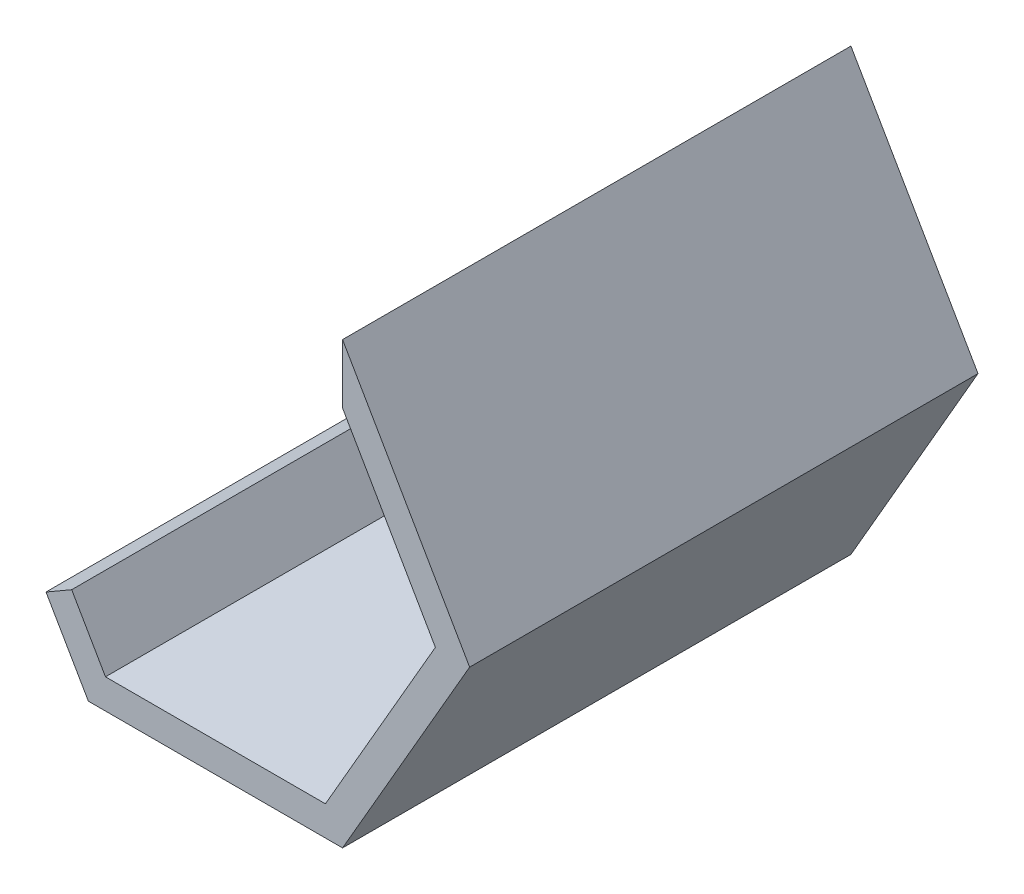
ISO-10303-21;
HEADER;
FILE_DESCRIPTION(('STEP AP214'),'2;1');
FILE_NAME('part.step','',(''),(''),'','','');
FILE_SCHEMA(('AUTOMOTIVE_DESIGN { 1 0 10303 214 1 1 1 1 }'));
ENDSEC;
DATA;
#1=APPLICATION_CONTEXT('core data for automotive mechanical design processes');
#2=APPLICATION_PROTOCOL_DEFINITION('international standard','automotive_design',2000,#1);
#3=PRODUCT_CONTEXT('',#1,'mechanical');
#4=PRODUCT('Part','Part','',(#3));
#5=PRODUCT_RELATED_PRODUCT_CATEGORY('part','',(#4));
#6=PRODUCT_DEFINITION_FORMATION('','',#4);
#7=PRODUCT_DEFINITION_CONTEXT('part definition',#1,'design');
#8=PRODUCT_DEFINITION('design','',#6,#7);
#9=PRODUCT_DEFINITION_SHAPE('','',#8);
#10=(LENGTH_UNIT() NAMED_UNIT(*) SI_UNIT(.MILLI.,.METRE.));
#11=(NAMED_UNIT(*) PLANE_ANGLE_UNIT() SI_UNIT($,.RADIAN.));
#12=(NAMED_UNIT(*) SI_UNIT($,.STERADIAN.) SOLID_ANGLE_UNIT());
#13=UNCERTAINTY_MEASURE_WITH_UNIT(LENGTH_MEASURE(1.E-05),#10,'distance_accuracy_value','');
#14=(GEOMETRIC_REPRESENTATION_CONTEXT(3) GLOBAL_UNCERTAINTY_ASSIGNED_CONTEXT((#13)) GLOBAL_UNIT_ASSIGNED_CONTEXT((#10,
#11,#12)) REPRESENTATION_CONTEXT('',''));
#15=CARTESIAN_POINT('',(0.,0.,0.));
#16=DIRECTION('',(0.,0.,1.));
#17=DIRECTION('',(1.,0.,0.));
#18=AXIS2_PLACEMENT_3D('',#15,#16,#17);
#19=CARTESIAN_POINT('',(-148.616811639848,-25.4663748274563,120.));
#20=DIRECTION('',(0.866025403784439,0.5,0.));
#21=DIRECTION('',(-0.5,0.866025403784439,0.));
#22=AXIS2_PLACEMENT_3D('',#19,#20,#21);
#23=PLANE('',#22);
#24=DIRECTION('',(0.5,-0.866025403784439,0.));
#25=VECTOR('',#24,1.);
#26=CARTESIAN_POINT('',(-148.616811639848,-25.4663748274563,0.));
#27=LINE('',#26,#25);
#28=CARTESIAN_POINT('',(-158.616811639848,-8.1458667517675,0.));
#29=VERTEX_POINT('',#28);
#30=CARTESIAN_POINT('',(-148.616811639848,-25.4663748274563,0.));
#31=VERTEX_POINT('',#30);
#32=EDGE_CURVE('E141',#29,#31,#27,.T.);
#33=ORIENTED_EDGE('',*,*,#32,.T.);
#34=DIRECTION('',(0.,0.,-1.));
#35=VECTOR('',#34,1.);
#36=CARTESIAN_POINT('',(-148.616811639848,-25.4663748274563,120.));
#37=LINE('',#36,#35);
#38=CARTESIAN_POINT('',(-148.616811639848,-25.4663748274563,120.));
#39=VERTEX_POINT('',#38);
#40=EDGE_CURVE('E11',#39,#31,#37,.T.);
#41=ORIENTED_EDGE('',*,*,#40,.F.);
#42=DIRECTION('',(0.5,-0.866025403784439,0.));
#43=VECTOR('',#42,1.);
#44=CARTESIAN_POINT('',(-148.616811639848,-25.4663748274563,120.));
#45=LINE('',#44,#43);
#46=CARTESIAN_POINT('',(-158.616811639848,-8.1458667517675,120.));
#47=VERTEX_POINT('',#46);
#48=EDGE_CURVE('E161',#47,#39,#45,.T.);
#49=ORIENTED_EDGE('',*,*,#48,.F.);
#50=DIRECTION('',(0.,0.,-1.));
#51=VECTOR('',#50,1.);
#52=CARTESIAN_POINT('',(-158.616811639848,-8.1458667517675,120.));
#53=LINE('',#52,#51);
#54=EDGE_CURVE('E137',#47,#29,#53,.T.);
#55=ORIENTED_EDGE('',*,*,#54,.T.);
#56=EDGE_LOOP('',(#33,#41,#49,#55));
#57=FACE_BOUND('',#56,.T.);
#58=ADVANCED_FACE('F33',(#57),#23,.F.);
#59=CARTESIAN_POINT('',(-148.616811639848,-25.4663748274563,120.));
#60=DIRECTION('',(0.,1.,0.));
#61=DIRECTION('',(-1.,0.,0.));
#62=AXIS2_PLACEMENT_3D('',#59,#60,#61);
#63=PLANE('',#62);
#64=DIRECTION('',(1.,0.,0.));
#65=VECTOR('',#64,1.);
#66=CARTESIAN_POINT('',(-148.616811639848,-25.4663748274563,0.));
#67=LINE('',#66,#65);
#68=CARTESIAN_POINT('',(-88.6168116398483,-25.4663748274563,0.));
#69=VERTEX_POINT('',#68);
#70=EDGE_CURVE('E144',#31,#69,#67,.T.);
#71=ORIENTED_EDGE('',*,*,#70,.T.);
#72=DIRECTION('',(0.,0.,-1.));
#73=VECTOR('',#72,1.);
#74=CARTESIAN_POINT('',(-88.6168116398483,-25.4663748274563,120.));
#75=LINE('',#74,#73);
#76=CARTESIAN_POINT('',(-88.6168116398483,-25.4663748274563,120.));
#77=VERTEX_POINT('',#76);
#78=EDGE_CURVE('E41',#77,#69,#75,.T.);
#79=ORIENTED_EDGE('',*,*,#78,.F.);
#80=DIRECTION('',(1.,0.,0.));
#81=VECTOR('',#80,1.);
#82=CARTESIAN_POINT('',(-148.616811639848,-25.4663748274563,120.));
#83=LINE('',#82,#81);
#84=EDGE_CURVE('E98',#39,#77,#83,.T.);
#85=ORIENTED_EDGE('',*,*,#84,.F.);
#86=ORIENTED_EDGE('',*,*,#40,.T.);
#87=EDGE_LOOP('',(#71,#79,#85,#86));
#88=FACE_BOUND('',#87,.T.);
#89=ADVANCED_FACE('F208',(#88),#63,.F.);
#90=CARTESIAN_POINT('',(-88.6168116398483,-25.4663748274563,120.));
#91=DIRECTION('',(-0.866025403784439,0.5,0.));
#92=DIRECTION('',(-0.5,-0.866025403784439,0.));
#93=AXIS2_PLACEMENT_3D('',#90,#91,#92);
#94=PLANE('',#93);
#95=DIRECTION('',(0.5,0.866025403784439,0.));
#96=VECTOR('',#95,1.);
#97=CARTESIAN_POINT('',(-88.6168116398483,-25.4663748274563,0.));
#98=LINE('',#97,#96);
#99=CARTESIAN_POINT('',(-58.6168116398483,26.49514939961,0.));
#100=VERTEX_POINT('',#99);
#101=EDGE_CURVE('E146',#69,#100,#98,.T.);
#102=ORIENTED_EDGE('',*,*,#101,.T.);
#103=DIRECTION('',(0.,0.,-1.));
#104=VECTOR('',#103,1.);
#105=CARTESIAN_POINT('',(-58.6168116398483,26.49514939961,120.));
#106=LINE('',#105,#104);
#107=CARTESIAN_POINT('',(-58.6168116398483,26.49514939961,120.));
#108=VERTEX_POINT('',#107);
#109=EDGE_CURVE('E174',#108,#100,#106,.T.);
#110=ORIENTED_EDGE('',*,*,#109,.F.);
#111=DIRECTION('',(0.5,0.866025403784439,0.));
#112=VECTOR('',#111,1.);
#113=CARTESIAN_POINT('',(-88.6168116398483,-25.4663748274563,120.));
#114=LINE('',#113,#112);
#115=EDGE_CURVE('E182',#77,#108,#114,.T.);
#116=ORIENTED_EDGE('',*,*,#115,.F.);
#117=ORIENTED_EDGE('',*,*,#78,.T.);
#118=EDGE_LOOP('',(#102,#110,#116,#117));
#119=FACE_BOUND('',#118,.T.);
#120=ADVANCED_FACE('F180',(#119),#94,.F.);
#121=CARTESIAN_POINT('',(-58.6168116398483,26.49514939961,120.));
#122=DIRECTION('',(-0.866025403784439,-0.5,0.));
#123=DIRECTION('',(0.5,-0.866025403784439,0.));
#124=AXIS2_PLACEMENT_3D('',#121,#122,#123);
#125=PLANE('',#124);
#126=DIRECTION('',(-0.5,0.866025403784439,0.));
#127=VECTOR('',#126,1.);
#128=CARTESIAN_POINT('',(-58.6168116398483,26.49514939961,0.));
#129=LINE('',#128,#127);
#130=CARTESIAN_POINT('',(-88.6168116398483,78.4566736266763,0.));
#131=VERTEX_POINT('',#130);
#132=EDGE_CURVE('E148',#100,#131,#129,.T.);
#133=ORIENTED_EDGE('',*,*,#132,.T.);
#134=DIRECTION('',(0.,0.,-1.));
#135=VECTOR('',#134,1.);
#136=CARTESIAN_POINT('',(-88.6168116398483,78.4566736266763,120.));
#137=LINE('',#136,#135);
#138=CARTESIAN_POINT('',(-88.6168116398483,78.4566736266763,120.));
#139=VERTEX_POINT('',#138);
#140=EDGE_CURVE('E171',#139,#131,#137,.T.);
#141=ORIENTED_EDGE('',*,*,#140,.F.);
#142=DIRECTION('',(-0.5,0.866025403784439,0.));
#143=VECTOR('',#142,1.);
#144=CARTESIAN_POINT('',(-58.6168116398483,26.49514939961,120.));
#145=LINE('',#144,#143);
#146=EDGE_CURVE('E198',#108,#139,#145,.T.);
#147=ORIENTED_EDGE('',*,*,#146,.F.);
#148=ORIENTED_EDGE('',*,*,#109,.T.);
#149=EDGE_LOOP('',(#133,#141,#147,#148));
#150=FACE_BOUND('',#149,.T.);
#151=ADVANCED_FACE('F189',(#150),#125,.F.);
#152=CARTESIAN_POINT('',(-88.6168116398483,64.4566736266762,120.));
#153=DIRECTION('',(1.,0.,0.));
#154=DIRECTION('',(0.,0.,-1.));
#155=AXIS2_PLACEMENT_3D('',#152,#153,#154);
#156=PLANE('',#155);
#157=DIRECTION('',(0.,-1.,0.));
#158=VECTOR('',#157,1.);
#159=CARTESIAN_POINT('',(-88.6168116398483,64.4566736266762,0.));
#160=LINE('',#159,#158);
#161=CARTESIAN_POINT('',(-88.6168116398483,64.4566736266762,0.));
#162=VERTEX_POINT('',#161);
#163=EDGE_CURVE('E151',#131,#162,#160,.T.);
#164=ORIENTED_EDGE('',*,*,#163,.T.);
#165=DIRECTION('',(0.,0.,-1.));
#166=VECTOR('',#165,1.);
#167=CARTESIAN_POINT('',(-88.6168116398483,64.4566736266762,120.));
#168=LINE('',#167,#166);
#169=CARTESIAN_POINT('',(-88.6168116398483,64.4566736266762,120.));
#170=VERTEX_POINT('',#169);
#171=EDGE_CURVE('E168',#170,#162,#168,.T.);
#172=ORIENTED_EDGE('',*,*,#171,.F.);
#173=DIRECTION('',(0.,-1.,0.));
#174=VECTOR('',#173,1.);
#175=CARTESIAN_POINT('',(-88.6168116398483,78.4566736266763,120.));
#176=LINE('',#175,#174);
#177=EDGE_CURVE('E195',#139,#170,#176,.T.);
#178=ORIENTED_EDGE('',*,*,#177,.F.);
#179=ORIENTED_EDGE('',*,*,#140,.T.);
#180=EDGE_LOOP('',(#164,#172,#178,#179));
#181=FACE_BOUND('',#180,.T.);
#182=ADVANCED_FACE('F193',(#181),#156,.F.);
#183=CARTESIAN_POINT('',(-82.2800555855672,53.4810901854917,120.));
#184=DIRECTION('',(0.866025403784439,0.5,0.));
#185=DIRECTION('',(-0.5,0.866025403784439,0.));
#186=AXIS2_PLACEMENT_3D('',#183,#184,#185);
#187=PLANE('',#186);
#188=DIRECTION('',(0.5,-0.866025403784439,0.));
#189=VECTOR('',#188,1.);
#190=CARTESIAN_POINT('',(-82.2800555855672,53.4810901854917,0.));
#191=LINE('',#190,#189);
#192=CARTESIAN_POINT('',(-66.699715408503,26.4951493996098,0.));
#193=VERTEX_POINT('',#192);
#194=EDGE_CURVE('E154',#162,#193,#191,.T.);
#195=ORIENTED_EDGE('',*,*,#194,.T.);
#196=DIRECTION('',(0.,0.,-1.));
#197=VECTOR('',#196,1.);
#198=CARTESIAN_POINT('',(-66.699715408503,26.4951493996098,120.));
#199=LINE('',#198,#197);
#200=CARTESIAN_POINT('',(-66.699715408503,26.4951493996098,120.));
#201=VERTEX_POINT('',#200);
#202=EDGE_CURVE('E165',#201,#193,#199,.T.);
#203=ORIENTED_EDGE('',*,*,#202,.F.);
#204=DIRECTION('',(0.5,-0.866025403784439,0.));
#205=VECTOR('',#204,1.);
#206=CARTESIAN_POINT('',(-82.2800555855672,53.4810901854917,120.));
#207=LINE('',#206,#205);
#208=EDGE_CURVE('E197',#170,#201,#207,.T.);
#209=ORIENTED_EDGE('',*,*,#208,.F.);
#210=ORIENTED_EDGE('',*,*,#171,.T.);
#211=EDGE_LOOP('',(#195,#203,#209,#210));
#212=FACE_BOUND('',#211,.T.);
#213=ADVANCED_FACE('F220',(#212),#187,.F.);
#214=CARTESIAN_POINT('',(-92.6582635241753,-18.4663748274562,120.));
#215=DIRECTION('',(0.86602540378444,-0.499999999999998,0.));
#216=DIRECTION('',(0.499999999999998,0.86602540378444,0.));
#217=AXIS2_PLACEMENT_3D('',#214,#215,#216);
#218=PLANE('',#217);
#219=DIRECTION('',(-0.499999999999998,-0.86602540378444,0.));
#220=VECTOR('',#219,1.);
#221=CARTESIAN_POINT('',(-92.6582635241753,-18.4663748274562,0.));
#222=LINE('',#221,#220);
#223=CARTESIAN_POINT('',(-92.6582635241753,-18.4663748274562,0.));
#224=VERTEX_POINT('',#223);
#225=EDGE_CURVE('E156',#193,#224,#222,.T.);
#226=ORIENTED_EDGE('',*,*,#225,.T.);
#227=DIRECTION('',(0.,0.,-1.));
#228=VECTOR('',#227,1.);
#229=CARTESIAN_POINT('',(-92.6582635241753,-18.4663748274562,120.));
#230=LINE('',#229,#228);
#231=CARTESIAN_POINT('',(-92.6582635241753,-18.4663748274562,120.));
#232=VERTEX_POINT('',#231);
#233=EDGE_CURVE('E132',#232,#224,#230,.T.);
#234=ORIENTED_EDGE('',*,*,#233,.F.);
#235=DIRECTION('',(-0.499999999999998,-0.86602540378444,0.));
#236=VECTOR('',#235,1.);
#237=CARTESIAN_POINT('',(-92.6582635241753,-18.4663748274562,120.));
#238=LINE('',#237,#236);
#239=EDGE_CURVE('E123',#201,#232,#238,.T.);
#240=ORIENTED_EDGE('',*,*,#239,.F.);
#241=ORIENTED_EDGE('',*,*,#202,.T.);
#242=EDGE_LOOP('',(#226,#234,#240,#241));
#243=FACE_BOUND('',#242,.T.);
#244=ADVANCED_FACE('F223',(#243),#218,.F.);
#245=CARTESIAN_POINT('',(-144.575359755521,-18.4663748274562,120.));
#246=DIRECTION('',(0.,-1.,0.));
#247=DIRECTION('',(0.,0.,-1.));
#248=AXIS2_PLACEMENT_3D('',#245,#246,#247);
#249=PLANE('',#248);
#250=DIRECTION('',(-1.,0.,0.));
#251=VECTOR('',#250,1.);
#252=CARTESIAN_POINT('',(-144.575359755521,-18.4663748274562,0.));
#253=LINE('',#252,#251);
#254=CARTESIAN_POINT('',(-144.575359755521,-18.4663748274562,0.));
#255=VERTEX_POINT('',#254);
#256=EDGE_CURVE('E131',#224,#255,#253,.T.);
#257=ORIENTED_EDGE('',*,*,#256,.T.);
#258=DIRECTION('',(0.,0.,-1.));
#259=VECTOR('',#258,1.);
#260=CARTESIAN_POINT('',(-144.575359755521,-18.4663748274562,120.));
#261=LINE('',#260,#259);
#262=CARTESIAN_POINT('',(-144.575359755521,-18.4663748274562,120.));
#263=VERTEX_POINT('',#262);
#264=EDGE_CURVE('E128',#263,#255,#261,.T.);
#265=ORIENTED_EDGE('',*,*,#264,.F.);
#266=DIRECTION('',(-1.,0.,0.));
#267=VECTOR('',#266,1.);
#268=CARTESIAN_POINT('',(-144.575359755521,-18.4663748274562,120.));
#269=LINE('',#268,#267);
#270=EDGE_CURVE('E117',#232,#263,#269,.T.);
#271=ORIENTED_EDGE('',*,*,#270,.F.);
#272=ORIENTED_EDGE('',*,*,#233,.T.);
#273=EDGE_LOOP('',(#257,#265,#271,#272));
#274=FACE_BOUND('',#273,.T.);
#275=ADVANCED_FACE('F129',(#274),#249,.F.);
#276=CARTESIAN_POINT('',(-152.554633813357,-4.64586675176749,120.));
#277=DIRECTION('',(-0.866025403784428,-0.500000000000018,0.));
#278=DIRECTION('',(0.500000000000018,-0.866025403784428,0.));
#279=AXIS2_PLACEMENT_3D('',#276,#277,#278);
#280=PLANE('',#279);
#281=DIRECTION('',(-0.500000000000018,0.866025403784428,0.));
#282=VECTOR('',#281,1.);
#283=CARTESIAN_POINT('',(-152.554633813357,-4.64586675176749,0.));
#284=LINE('',#283,#282);
#285=CARTESIAN_POINT('',(-152.554633813357,-4.64586675176749,0.));
#286=VERTEX_POINT('',#285);
#287=EDGE_CURVE('E84',#255,#286,#284,.T.);
#288=ORIENTED_EDGE('',*,*,#287,.T.);
#289=DIRECTION('',(0.,0.,-1.));
#290=VECTOR('',#289,1.);
#291=CARTESIAN_POINT('',(-152.554633813357,-4.64586675176749,120.));
#292=LINE('',#291,#290);
#293=CARTESIAN_POINT('',(-152.554633813357,-4.64586675176749,120.));
#294=VERTEX_POINT('',#293);
#295=EDGE_CURVE('E133',#294,#286,#292,.T.);
#296=ORIENTED_EDGE('',*,*,#295,.F.);
#297=DIRECTION('',(-0.500000000000018,0.866025403784428,0.));
#298=VECTOR('',#297,1.);
#299=CARTESIAN_POINT('',(-152.554633813357,-4.64586675176749,120.));
#300=LINE('',#299,#298);
#301=EDGE_CURVE('E121',#263,#294,#300,.T.);
#302=ORIENTED_EDGE('',*,*,#301,.F.);
#303=ORIENTED_EDGE('',*,*,#264,.T.);
#304=EDGE_LOOP('',(#288,#296,#302,#303));
#305=FACE_BOUND('',#304,.T.);
#306=ADVANCED_FACE('F135',(#305),#280,.F.);
#307=CARTESIAN_POINT('',(-158.616811639848,-8.1458667517675,120.));
#308=DIRECTION('',(0.500000000000001,-0.866025403784438,0.));
#309=DIRECTION('',(0.866025403784438,0.500000000000001,0.));
#310=AXIS2_PLACEMENT_3D('',#307,#308,#309);
#311=PLANE('',#310);
#312=DIRECTION('',(-0.866025403784438,-0.500000000000001,0.));
#313=VECTOR('',#312,1.);
#314=CARTESIAN_POINT('',(-158.616811639848,-8.1458667517675,0.));
#315=LINE('',#314,#313);
#316=EDGE_CURVE('E90',#286,#29,#315,.T.);
#317=ORIENTED_EDGE('',*,*,#316,.T.);
#318=ORIENTED_EDGE('',*,*,#54,.F.);
#319=DIRECTION('',(-0.866025403784438,-0.500000000000001,0.));
#320=VECTOR('',#319,1.);
#321=CARTESIAN_POINT('',(-158.616811639848,-8.1458667517675,120.));
#322=LINE('',#321,#320);
#323=EDGE_CURVE('E49',#294,#47,#322,.T.);
#324=ORIENTED_EDGE('',*,*,#323,.F.);
#325=ORIENTED_EDGE('',*,*,#295,.T.);
#326=EDGE_LOOP('',(#317,#318,#324,#325));
#327=FACE_BOUND('',#326,.T.);
#328=ADVANCED_FACE('F232',(#327),#311,.F.);
#329=CARTESIAN_POINT('',(0.,0.,120.));
#330=DIRECTION('',(0.,0.,-1.));
#331=DIRECTION('',(-1.,0.,0.));
#332=AXIS2_PLACEMENT_3D('',#329,#330,#331);
#333=PLANE('',#332);
#334=ORIENTED_EDGE('',*,*,#48,.T.);
#335=ORIENTED_EDGE('',*,*,#84,.T.);
#336=ORIENTED_EDGE('',*,*,#115,.T.);
#337=ORIENTED_EDGE('',*,*,#146,.T.);
#338=ORIENTED_EDGE('',*,*,#177,.T.);
#339=ORIENTED_EDGE('',*,*,#208,.T.);
#340=ORIENTED_EDGE('',*,*,#239,.T.);
#341=ORIENTED_EDGE('',*,*,#270,.T.);
#342=ORIENTED_EDGE('',*,*,#301,.T.);
#343=ORIENTED_EDGE('',*,*,#323,.T.);
#344=EDGE_LOOP('',(#334,#335,#336,#337,#338,#339,#340,#341,#342,#343));
#345=FACE_BOUND('',#344,.T.);
#346=ADVANCED_FACE('F119',(#345),#333,.F.);
#347=CARTESIAN_POINT('',(0.,0.,0.));
#348=DIRECTION('',(0.,0.,-1.));
#349=DIRECTION('',(-1.,0.,0.));
#350=AXIS2_PLACEMENT_3D('',#347,#348,#349);
#351=PLANE('',#350);
#352=ORIENTED_EDGE('',*,*,#32,.F.);
#353=ORIENTED_EDGE('',*,*,#316,.F.);
#354=ORIENTED_EDGE('',*,*,#287,.F.);
#355=ORIENTED_EDGE('',*,*,#256,.F.);
#356=ORIENTED_EDGE('',*,*,#225,.F.);
#357=ORIENTED_EDGE('',*,*,#194,.F.);
#358=ORIENTED_EDGE('',*,*,#163,.F.);
#359=ORIENTED_EDGE('',*,*,#132,.F.);
#360=ORIENTED_EDGE('',*,*,#101,.F.);
#361=ORIENTED_EDGE('',*,*,#70,.F.);
#362=EDGE_LOOP('',(#352,#353,#354,#355,#356,#357,#358,#359,#360,#361));
#363=FACE_BOUND('',#362,.T.);
#364=ADVANCED_FACE('F186',(#363),#351,.T.);
#365=CLOSED_SHELL('',(#58,#89,#120,#151,#182,#213,#244,#275,#306,#328,#346,#364));
#366=MANIFOLD_SOLID_BREP('B2',#365);
#367=ADVANCED_BREP_SHAPE_REPRESENTATION('',(#18,#366),#14);
#368=SHAPE_DEFINITION_REPRESENTATION(#9,#367);
ENDSEC;
END-ISO-10303-21;
